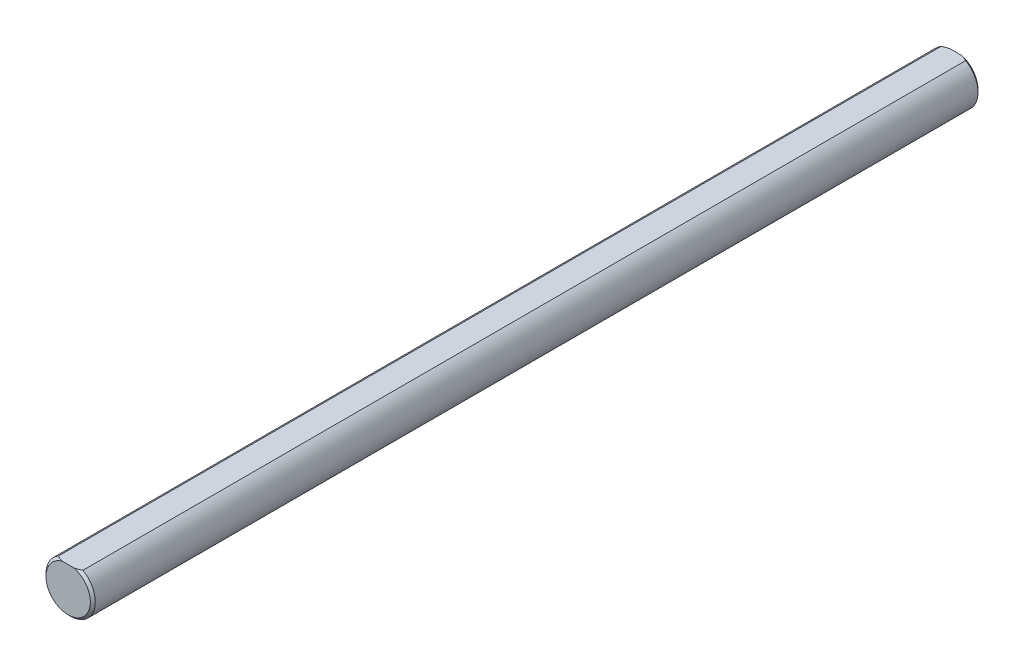
ISO-10303-21;
HEADER;
FILE_DESCRIPTION(('STEP AP214'),'2;1');
FILE_NAME('part.step','',(''),(''),'','','');
FILE_SCHEMA(('AUTOMOTIVE_DESIGN { 1 0 10303 214 1 1 1 1 }'));
ENDSEC;
DATA;
#1=APPLICATION_CONTEXT('core data for automotive mechanical design processes');
#2=APPLICATION_PROTOCOL_DEFINITION('international standard','automotive_design',2000,#1);
#3=PRODUCT_CONTEXT('',#1,'mechanical');
#4=PRODUCT('Part','Part','',(#3));
#5=PRODUCT_RELATED_PRODUCT_CATEGORY('part','',(#4));
#6=PRODUCT_DEFINITION_FORMATION('','',#4);
#7=PRODUCT_DEFINITION_CONTEXT('part definition',#1,'design');
#8=PRODUCT_DEFINITION('design','',#6,#7);
#9=PRODUCT_DEFINITION_SHAPE('','',#8);
#10=(LENGTH_UNIT() NAMED_UNIT(*) SI_UNIT(.MILLI.,.METRE.));
#11=(NAMED_UNIT(*) PLANE_ANGLE_UNIT() SI_UNIT($,.RADIAN.));
#12=(NAMED_UNIT(*) SI_UNIT($,.STERADIAN.) SOLID_ANGLE_UNIT());
#13=UNCERTAINTY_MEASURE_WITH_UNIT(LENGTH_MEASURE(1.E-05),#10,'distance_accuracy_value','');
#14=(GEOMETRIC_REPRESENTATION_CONTEXT(3) GLOBAL_UNCERTAINTY_ASSIGNED_CONTEXT((#13)) GLOBAL_UNIT_ASSIGNED_CONTEXT((#10,
#11,#12)) REPRESENTATION_CONTEXT('',''));
#15=CARTESIAN_POINT('',(0.,0.,0.));
#16=DIRECTION('',(0.,0.,1.));
#17=DIRECTION('',(1.,0.,0.));
#18=AXIS2_PLACEMENT_3D('',#15,#16,#17);
#19=CARTESIAN_POINT('',(0.,0.,57.15));
#20=DIRECTION('',(0.,0.,-1.));
#21=DIRECTION('',(-1.,0.,0.));
#22=AXIS2_PLACEMENT_3D('',#19,#20,#21);
#23=CYLINDRICAL_SURFACE('',#22,3.175);
#24=DIRECTION('',(0.,0.,1.));
#25=VECTOR('',#24,1.);
#26=CARTESIAN_POINT('',(-1.5875,2.74963065701559,-57.15));
#27=LINE('',#26,#25);
#28=CARTESIAN_POINT('',(-1.5875,2.74963065701559,-56.8325));
#29=VERTEX_POINT('',#28);
#30=CARTESIAN_POINT('',(-1.5875,2.74963065701559,56.8325));
#31=VERTEX_POINT('',#30);
#32=EDGE_CURVE('E84',#29,#31,#27,.T.);
#33=ORIENTED_EDGE('',*,*,#32,.F.);
#34=CARTESIAN_POINT('',(0.,0.,-56.8325));
#35=DIRECTION('',(0.,0.,1.));
#36=DIRECTION('',(1.,0.,0.));
#37=AXIS2_PLACEMENT_3D('',#34,#35,#36);
#38=CIRCLE('',#37,3.175);
#39=CARTESIAN_POINT('',(1.5875,2.74963065701559,-56.8325));
#40=VERTEX_POINT('',#39);
#41=EDGE_CURVE('E95',#29,#40,#38,.T.);
#42=ORIENTED_EDGE('',*,*,#41,.T.);
#43=DIRECTION('',(0.,0.,1.));
#44=VECTOR('',#43,1.);
#45=CARTESIAN_POINT('',(1.5875,2.74963065701559,-57.15));
#46=LINE('',#45,#44);
#47=CARTESIAN_POINT('',(1.5875,2.74963065701559,56.8325));
#48=VERTEX_POINT('',#47);
#49=EDGE_CURVE('E97',#40,#48,#46,.T.);
#50=ORIENTED_EDGE('',*,*,#49,.T.);
#51=CARTESIAN_POINT('',(0.,0.,56.8325));
#52=DIRECTION('',(0.,0.,1.));
#53=DIRECTION('',(1.,0.,0.));
#54=AXIS2_PLACEMENT_3D('',#51,#52,#53);
#55=CIRCLE('',#54,3.175);
#56=EDGE_CURVE('E96',#48,#31,#55,.F.);
#57=ORIENTED_EDGE('',*,*,#56,.T.);
#58=EDGE_LOOP('',(#33,#42,#50,#57));
#59=FACE_BOUND('',#58,.T.);
#60=ADVANCED_FACE('F37',(#59),#23,.T.);
#61=CARTESIAN_POINT('',(0.,0.,57.15));
#62=DIRECTION('',(0.,0.,1.));
#63=DIRECTION('',(1.,0.,0.));
#64=AXIS2_PLACEMENT_3D('',#61,#62,#63);
#65=PLANE('',#64);
#66=DIRECTION('',(1.,0.,0.));
#67=VECTOR('',#66,1.);
#68=CARTESIAN_POINT('',(-1.5875,2.74963065701559,57.15));
#69=LINE('',#68,#67);
#70=CARTESIAN_POINT('',(-0.777712993333603,2.74963065701559,57.15));
#71=VERTEX_POINT('',#70);
#72=CARTESIAN_POINT('',(0.777712993333603,2.74963065701559,57.15));
#73=VERTEX_POINT('',#72);
#74=EDGE_CURVE('E142',#71,#73,#69,.T.);
#75=ORIENTED_EDGE('',*,*,#74,.F.);
#76=CARTESIAN_POINT('',(0.,0.,57.15));
#77=DIRECTION('',(0.,0.,1.));
#78=DIRECTION('',(1.,0.,0.));
#79=AXIS2_PLACEMENT_3D('',#76,#77,#78);
#80=CIRCLE('',#79,2.85749999999998);
#81=EDGE_CURVE('E11',#71,#73,#80,.T.);
#82=ORIENTED_EDGE('',*,*,#81,.T.);
#83=EDGE_LOOP('',(#75,#82));
#84=FACE_BOUND('',#83,.T.);
#85=ADVANCED_FACE('F135',(#84),#65,.T.);
#86=CARTESIAN_POINT('',(0.,0.,-57.15));
#87=DIRECTION('',(0.,0.,1.));
#88=DIRECTION('',(1.,0.,0.));
#89=AXIS2_PLACEMENT_3D('',#86,#87,#88);
#90=PLANE('',#89);
#91=DIRECTION('',(1.,0.,0.));
#92=VECTOR('',#91,1.);
#93=CARTESIAN_POINT('',(-1.5875,2.74963065701559,-57.15));
#94=LINE('',#93,#92);
#95=CARTESIAN_POINT('',(-0.777712993333554,2.74963065701559,-57.15));
#96=VERTEX_POINT('',#95);
#97=CARTESIAN_POINT('',(0.777712993333554,2.74963065701559,-57.15));
#98=VERTEX_POINT('',#97);
#99=EDGE_CURVE('E86',#96,#98,#94,.T.);
#100=ORIENTED_EDGE('',*,*,#99,.T.);
#101=CARTESIAN_POINT('',(0.,0.,-57.15));
#102=DIRECTION('',(0.,0.,1.));
#103=DIRECTION('',(1.,0.,0.));
#104=AXIS2_PLACEMENT_3D('',#101,#102,#103);
#105=CIRCLE('',#104,2.85749999999997);
#106=EDGE_CURVE('E46',#98,#96,#105,.F.);
#107=ORIENTED_EDGE('',*,*,#106,.T.);
#108=EDGE_LOOP('',(#100,#107));
#109=FACE_BOUND('',#108,.T.);
#110=ADVANCED_FACE('F116',(#109),#90,.F.);
#111=CARTESIAN_POINT('',(-1.5875,2.74963065701559,-57.15));
#112=DIRECTION('',(0.,-1.,0.));
#113=DIRECTION('',(0.,0.,-1.));
#114=AXIS2_PLACEMENT_3D('',#111,#112,#113);
#115=PLANE('',#114);
#116=ORIENTED_EDGE('',*,*,#49,.F.);
#117=CARTESIAN_POINT('',(1.5875,2.74963065701559,-56.8325));
#118=CARTESIAN_POINT('',(1.52250516699269,2.74963065701559,-56.8649880824798));
#119=CARTESIAN_POINT('',(1.45690188238028,2.74963065701559,-56.8963019076194));
#120=CARTESIAN_POINT('',(1.32458227077019,2.74963065701559,-56.9560258514252));
#121=CARTESIAN_POINT('',(1.25786903887729,2.74963065701559,-56.9844428470168));
#122=CARTESIAN_POINT('',(1.12308918002492,2.74963065701559,-57.0379920057044));
#123=CARTESIAN_POINT('',(1.05502199036171,2.74963065701559,-57.0631227687341));
#124=CARTESIAN_POINT('',(0.917422256787906,2.74963065701559,-57.1095821959475));
#125=CARTESIAN_POINT('',(0.847886543275432,2.74963065701559,-57.1309014355307));
#126=CARTESIAN_POINT('',(0.777712993333556,2.74963065701559,-57.15));
#127=B_SPLINE_CURVE_WITH_KNOTS('',3,(#117,#118,#119,#120,#121,#122,#123,#124,#125,#126),
.UNSPECIFIED.,.F.,.F.,(4,2,2,2,4),(0.,0.218002568777806,0.435474929897204,0.653039643130622,
0.871135095680672),.UNSPECIFIED.);
#128=EDGE_CURVE('E90',#40,#98,#127,.T.);
#129=ORIENTED_EDGE('',*,*,#128,.T.);
#130=ORIENTED_EDGE('',*,*,#99,.F.);
#131=CARTESIAN_POINT('',(-0.777712993333554,2.74963065701559,-57.15));
#132=CARTESIAN_POINT('',(-0.847886543275431,2.74963065701559,-57.1309014355307));
#133=CARTESIAN_POINT('',(-0.917422256787905,2.74963065701559,-57.1095821959475));
#134=CARTESIAN_POINT('',(-1.05502199036171,2.74963065701559,-57.0631227687341));
#135=CARTESIAN_POINT('',(-1.12308918002492,2.74963065701559,-57.0379920057044));
#136=CARTESIAN_POINT('',(-1.25786903887729,2.74963065701559,-56.9844428470168));
#137=CARTESIAN_POINT('',(-1.32458227077019,2.74963065701559,-56.9560258514252));
#138=CARTESIAN_POINT('',(-1.45690188238028,2.74963065701559,-56.8963019076194));
#139=CARTESIAN_POINT('',(-1.52250516699269,2.74963065701559,-56.8649880824798));
#140=CARTESIAN_POINT('',(-1.5875,2.74963065701559,-56.8325));
#141=B_SPLINE_CURVE_WITH_KNOTS('',3,(#131,#132,#133,#134,#135,#136,#137,#138,#139,#140),
.UNSPECIFIED.,.F.,.F.,(4,2,2,2,4),(0.,0.218095452550051,0.435660165783469,0.653132526902868,
0.871135095680674),.UNSPECIFIED.);
#142=EDGE_CURVE('E80',#96,#29,#141,.T.);
#143=ORIENTED_EDGE('',*,*,#142,.T.);
#144=ORIENTED_EDGE('',*,*,#32,.T.);
#145=CARTESIAN_POINT('',(-1.5875,2.74963065701559,56.8325));
#146=CARTESIAN_POINT('',(-1.52250516699269,2.74963065701559,56.8649880824799));
#147=CARTESIAN_POINT('',(-1.45690188238029,2.74963065701559,56.8963019076194));
#148=CARTESIAN_POINT('',(-1.3245822707702,2.74963065701559,56.9560258514252));
#149=CARTESIAN_POINT('',(-1.25786903887731,2.74963065701559,56.9844428470168));
#150=CARTESIAN_POINT('',(-1.12308918002495,2.74963065701559,57.0379920057044));
#151=CARTESIAN_POINT('',(-1.05502199036174,2.74963065701559,57.0631227687341));
#152=CARTESIAN_POINT('',(-0.917422256787943,2.74963065701559,57.1095821959475));
#153=CARTESIAN_POINT('',(-0.847886543275474,2.74963065701559,57.1309014355307));
#154=CARTESIAN_POINT('',(-0.777712993333604,2.74963065701559,57.15));
#155=B_SPLINE_CURVE_WITH_KNOTS('',3,(#145,#146,#147,#148,#149,#150,#151,#152,#153,#154),
.UNSPECIFIED.,.F.,.F.,(4,2,2,2,4),(0.,0.218002568777793,0.435474929897178,0.653039643130584,
0.871135095680619),.UNSPECIFIED.);
#156=EDGE_CURVE('E60',#31,#71,#155,.T.);
#157=ORIENTED_EDGE('',*,*,#156,.T.);
#158=ORIENTED_EDGE('',*,*,#74,.T.);
#159=CARTESIAN_POINT('',(0.777712993333603,2.74963065701559,57.15));
#160=CARTESIAN_POINT('',(0.847886543275474,2.74963065701559,57.1309014355307));
#161=CARTESIAN_POINT('',(0.917422256787944,2.74963065701559,57.1095821959475));
#162=CARTESIAN_POINT('',(1.05502199036174,2.74963065701559,57.0631227687341));
#163=CARTESIAN_POINT('',(1.12308918002495,2.74963065701559,57.0379920057044));
#164=CARTESIAN_POINT('',(1.25786903887731,2.74963065701559,56.9844428470168));
#165=CARTESIAN_POINT('',(1.3245822707702,2.74963065701559,56.9560258514252));
#166=CARTESIAN_POINT('',(1.45690188238029,2.74963065701559,56.8963019076194));
#167=CARTESIAN_POINT('',(1.5225051669927,2.74963065701559,56.8649880824799));
#168=CARTESIAN_POINT('',(1.5875,2.74963065701559,56.8325));
#169=B_SPLINE_CURVE_WITH_KNOTS('',3,(#159,#160,#161,#162,#163,#164,#165,#166,#167,#168),
.UNSPECIFIED.,.F.,.F.,(4,2,2,2,4),(0.,0.218095452550037,0.43566016578344,0.653132526902827,
0.87113509568062),.UNSPECIFIED.);
#170=EDGE_CURVE('E53',#73,#48,#169,.T.);
#171=ORIENTED_EDGE('',*,*,#170,.T.);
#172=EDGE_LOOP('',(#116,#129,#130,#143,#144,#157,#158,#171));
#173=FACE_BOUND('',#172,.T.);
#174=ADVANCED_FACE('F83',(#173),#115,.F.);
#175=CARTESIAN_POINT('',(0.,0.,-56.8325));
#176=DIRECTION('',(0.,0.,1.));
#177=DIRECTION('',(1.,0.,0.));
#178=AXIS2_PLACEMENT_3D('',#175,#176,#177);
#179=CONICAL_SURFACE('',#178,3.175,0.785398163397431);
#180=ORIENTED_EDGE('',*,*,#142,.F.);
#181=ORIENTED_EDGE('',*,*,#106,.F.);
#182=ORIENTED_EDGE('',*,*,#128,.F.);
#183=ORIENTED_EDGE('',*,*,#41,.F.);
#184=EDGE_LOOP('',(#180,#181,#182,#183));
#185=FACE_BOUND('',#184,.T.);
#186=ADVANCED_FACE('F99',(#185),#179,.T.);
#187=CARTESIAN_POINT('',(0.,0.,57.15));
#188=DIRECTION('',(0.,0.,-1.));
#189=DIRECTION('',(-1.,0.,0.));
#190=AXIS2_PLACEMENT_3D('',#187,#188,#189);
#191=CONICAL_SURFACE('',#190,2.85749999999998,0.785398163397442);
#192=ORIENTED_EDGE('',*,*,#156,.F.);
#193=ORIENTED_EDGE('',*,*,#56,.F.);
#194=ORIENTED_EDGE('',*,*,#170,.F.);
#195=ORIENTED_EDGE('',*,*,#81,.F.);
#196=EDGE_LOOP('',(#192,#193,#194,#195));
#197=FACE_BOUND('',#196,.T.);
#198=ADVANCED_FACE('F39',(#197),#191,.T.);
#199=CLOSED_SHELL('',(#60,#85,#110,#174,#186,#198));
#200=MANIFOLD_SOLID_BREP('B2',#199);
#201=ADVANCED_BREP_SHAPE_REPRESENTATION('',(#18,#200),#14);
#202=SHAPE_DEFINITION_REPRESENTATION(#9,#201);
ENDSEC;
END-ISO-10303-21;
